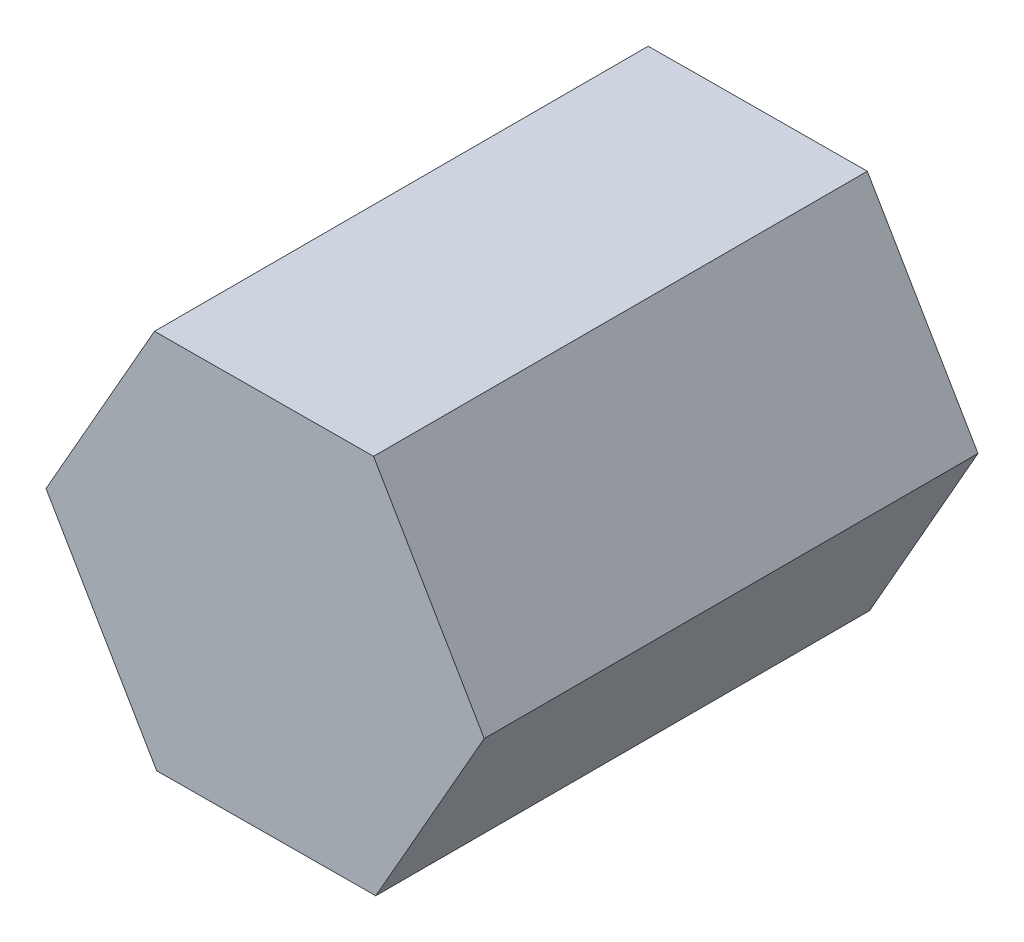
ISO-10303-21;
HEADER;
FILE_DESCRIPTION(('STEP AP214'),'2;1');
FILE_NAME('part.step','',(''),(''),'','','');
FILE_SCHEMA(('AUTOMOTIVE_DESIGN { 1 0 10303 214 1 1 1 1 }'));
ENDSEC;
DATA;
#1=APPLICATION_CONTEXT('core data for automotive mechanical design processes');
#2=APPLICATION_PROTOCOL_DEFINITION('international standard','automotive_design',2000,#1);
#3=PRODUCT_CONTEXT('',#1,'mechanical');
#4=PRODUCT('Part','Part','',(#3));
#5=PRODUCT_RELATED_PRODUCT_CATEGORY('part','',(#4));
#6=PRODUCT_DEFINITION_FORMATION('','',#4);
#7=PRODUCT_DEFINITION_CONTEXT('part definition',#1,'design');
#8=PRODUCT_DEFINITION('design','',#6,#7);
#9=PRODUCT_DEFINITION_SHAPE('','',#8);
#10=(LENGTH_UNIT() NAMED_UNIT(*) SI_UNIT(.MILLI.,.METRE.));
#11=(NAMED_UNIT(*) PLANE_ANGLE_UNIT() SI_UNIT($,.RADIAN.));
#12=(NAMED_UNIT(*) SI_UNIT($,.STERADIAN.) SOLID_ANGLE_UNIT());
#13=UNCERTAINTY_MEASURE_WITH_UNIT(LENGTH_MEASURE(1.E-05),#10,'distance_accuracy_value','');
#14=(GEOMETRIC_REPRESENTATION_CONTEXT(3) GLOBAL_UNCERTAINTY_ASSIGNED_CONTEXT((#13)) GLOBAL_UNIT_ASSIGNED_CONTEXT((#10,
#11,#12)) REPRESENTATION_CONTEXT('',''));
#15=CARTESIAN_POINT('',(0.,0.,0.));
#16=DIRECTION('',(0.,0.,1.));
#17=DIRECTION('',(1.,0.,0.));
#18=AXIS2_PLACEMENT_3D('',#15,#16,#17);
#19=CARTESIAN_POINT('',(35.1393052509974,61.694645038911,160.));
#20=DIRECTION('',(0.00585621832050525,-0.999982852206468,0.));
#21=DIRECTION('',(0.999982852206468,0.00585621832050525,0.));
#22=AXIS2_PLACEMENT_3D('',#19,#20,#21);
#23=PLANE('',#22);
#24=DIRECTION('',(-0.999982852206468,-0.00585621832050525,0.));
#25=VECTOR('',#24,1.);
#26=CARTESIAN_POINT('',(35.1393052509974,61.694645038911,0.));
#27=LINE('',#26,#25);
#28=CARTESIAN_POINT('',(35.1393052509974,61.694645038911,0.));
#29=VERTEX_POINT('',#28);
#30=CARTESIAN_POINT('',(-35.8594772556619,61.2788535381551,0.));
#31=VERTEX_POINT('',#30);
#32=EDGE_CURVE('E117',#29,#31,#27,.T.);
#33=ORIENTED_EDGE('',*,*,#32,.T.);
#34=DIRECTION('',(0.,0.,-1.));
#35=VECTOR('',#34,1.);
#36=CARTESIAN_POINT('',(-35.8594772556619,61.2788535381551,160.));
#37=LINE('',#36,#35);
#38=CARTESIAN_POINT('',(-35.8594772556619,61.2788535381551,160.));
#39=VERTEX_POINT('',#38);
#40=EDGE_CURVE('E11',#39,#31,#37,.T.);
#41=ORIENTED_EDGE('',*,*,#40,.F.);
#42=DIRECTION('',(-0.999982852206468,-0.00585621832050525,0.));
#43=VECTOR('',#42,1.);
#44=CARTESIAN_POINT('',(35.1393052509974,61.694645038911,160.));
#45=LINE('',#44,#43);
#46=CARTESIAN_POINT('',(35.1393052509974,61.694645038911,160.));
#47=VERTEX_POINT('',#46);
#48=EDGE_CURVE('E127',#47,#39,#45,.T.);
#49=ORIENTED_EDGE('',*,*,#48,.F.);
#50=DIRECTION('',(0.,0.,-1.));
#51=VECTOR('',#50,1.);
#52=CARTESIAN_POINT('',(35.1393052509974,61.694645038911,160.));
#53=LINE('',#52,#51);
#54=EDGE_CURVE('E113',#47,#29,#53,.T.);
#55=ORIENTED_EDGE('',*,*,#54,.T.);
#56=EDGE_LOOP('',(#33,#41,#49,#55));
#57=FACE_BOUND('',#56,.T.);
#58=ADVANCED_FACE('F33',(#57),#23,.F.);
#59=CARTESIAN_POINT('',(-35.8594772556619,61.2788535381551,160.));
#60=DIRECTION('',(0.868938662519874,-0.494919792267568,0.));
#61=DIRECTION('',(0.494919792267568,0.868938662519874,0.));
#62=AXIS2_PLACEMENT_3D('',#59,#60,#61);
#63=PLANE('',#62);
#64=DIRECTION('',(-0.494919792267568,-0.868938662519874,0.));
#65=VECTOR('',#64,1.);
#66=CARTESIAN_POINT('',(-35.8594772556619,61.2788535381551,0.));
#67=LINE('',#66,#65);
#68=CARTESIAN_POINT('',(-70.9987825066592,-0.415791500755921,0.));
#69=VERTEX_POINT('',#68);
#70=EDGE_CURVE('E120',#31,#69,#67,.T.);
#71=ORIENTED_EDGE('',*,*,#70,.T.);
#72=DIRECTION('',(0.,0.,-1.));
#73=VECTOR('',#72,1.);
#74=CARTESIAN_POINT('',(-70.9987825066592,-0.415791500755921,160.));
#75=LINE('',#74,#73);
#76=CARTESIAN_POINT('',(-70.9987825066592,-0.415791500755921,160.));
#77=VERTEX_POINT('',#76);
#78=EDGE_CURVE('E41',#77,#69,#75,.T.);
#79=ORIENTED_EDGE('',*,*,#78,.F.);
#80=DIRECTION('',(-0.494919792267568,-0.868938662519874,0.));
#81=VECTOR('',#80,1.);
#82=CARTESIAN_POINT('',(-35.8594772556619,61.2788535381551,160.));
#83=LINE('',#82,#81);
#84=EDGE_CURVE('E86',#39,#77,#83,.T.);
#85=ORIENTED_EDGE('',*,*,#84,.F.);
#86=ORIENTED_EDGE('',*,*,#40,.T.);
#87=EDGE_LOOP('',(#71,#79,#85,#86));
#88=FACE_BOUND('',#87,.T.);
#89=ADVANCED_FACE('F151',(#88),#63,.F.);
#90=CARTESIAN_POINT('',(-70.9987825066592,-0.415791500755921,160.));
#91=DIRECTION('',(0.863082444199368,0.5050630599389,0.));
#92=DIRECTION('',(-0.5050630599389,0.863082444199368,0.));
#93=AXIS2_PLACEMENT_3D('',#90,#91,#92);
#94=PLANE('',#93);
#95=DIRECTION('',(0.5050630599389,-0.863082444199368,0.));
#96=VECTOR('',#95,1.);
#97=CARTESIAN_POINT('',(-70.9987825066592,-0.415791500755921,0.));
#98=LINE('',#97,#96);
#99=CARTESIAN_POINT('',(-35.1393052509973,-61.6946450389111,0.));
#100=VERTEX_POINT('',#99);
#101=EDGE_CURVE('E122',#69,#100,#98,.T.);
#102=ORIENTED_EDGE('',*,*,#101,.T.);
#103=DIRECTION('',(0.,0.,-1.));
#104=VECTOR('',#103,1.);
#105=CARTESIAN_POINT('',(-35.1393052509973,-61.6946450389111,160.));
#106=LINE('',#105,#104);
#107=CARTESIAN_POINT('',(-35.1393052509973,-61.6946450389111,160.));
#108=VERTEX_POINT('',#107);
#109=EDGE_CURVE('E108',#108,#100,#106,.T.);
#110=ORIENTED_EDGE('',*,*,#109,.F.);
#111=DIRECTION('',(0.5050630599389,-0.863082444199368,0.));
#112=VECTOR('',#111,1.);
#113=CARTESIAN_POINT('',(-70.9987825066592,-0.415791500755921,160.));
#114=LINE('',#113,#112);
#115=EDGE_CURVE('E99',#77,#108,#114,.T.);
#116=ORIENTED_EDGE('',*,*,#115,.F.);
#117=ORIENTED_EDGE('',*,*,#78,.T.);
#118=EDGE_LOOP('',(#102,#110,#116,#117));
#119=FACE_BOUND('',#118,.T.);
#120=ADVANCED_FACE('F133',(#119),#94,.F.);
#121=CARTESIAN_POINT('',(-35.1393052509973,-61.6946450389111,160.));
#122=DIRECTION('',(-0.00585621832050565,0.999982852206468,0.));
#123=DIRECTION('',(-0.999982852206468,-0.00585621832050565,0.));
#124=AXIS2_PLACEMENT_3D('',#121,#122,#123);
#125=PLANE('',#124);
#126=DIRECTION('',(0.999982852206468,0.00585621832050565,0.));
#127=VECTOR('',#126,1.);
#128=CARTESIAN_POINT('',(-35.1393052509973,-61.6946450389111,0.));
#129=LINE('',#128,#127);
#130=CARTESIAN_POINT('',(35.8594772556619,-61.2788535381552,0.));
#131=VERTEX_POINT('',#130);
#132=EDGE_CURVE('E107',#100,#131,#129,.T.);
#133=ORIENTED_EDGE('',*,*,#132,.T.);
#134=DIRECTION('',(0.,0.,-1.));
#135=VECTOR('',#134,1.);
#136=CARTESIAN_POINT('',(35.8594772556619,-61.2788535381552,160.));
#137=LINE('',#136,#135);
#138=CARTESIAN_POINT('',(35.8594772556619,-61.2788535381552,160.));
#139=VERTEX_POINT('',#138);
#140=EDGE_CURVE('E104',#139,#131,#137,.T.);
#141=ORIENTED_EDGE('',*,*,#140,.F.);
#142=DIRECTION('',(0.999982852206468,0.00585621832050565,0.));
#143=VECTOR('',#142,1.);
#144=CARTESIAN_POINT('',(-35.1393052509973,-61.6946450389111,160.));
#145=LINE('',#144,#143);
#146=EDGE_CURVE('E93',#108,#139,#145,.T.);
#147=ORIENTED_EDGE('',*,*,#146,.F.);
#148=ORIENTED_EDGE('',*,*,#109,.T.);
#149=EDGE_LOOP('',(#133,#141,#147,#148));
#150=FACE_BOUND('',#149,.T.);
#151=ADVANCED_FACE('F105',(#150),#125,.F.);
#152=CARTESIAN_POINT('',(35.8594772556619,-61.2788535381552,160.));
#153=DIRECTION('',(-0.868938662519874,0.494919792267568,0.));
#154=DIRECTION('',(-0.494919792267568,-0.868938662519874,0.));
#155=AXIS2_PLACEMENT_3D('',#152,#153,#154);
#156=PLANE('',#155);
#157=DIRECTION('',(0.494919792267568,0.868938662519874,0.));
#158=VECTOR('',#157,1.);
#159=CARTESIAN_POINT('',(35.8594772556619,-61.2788535381552,0.));
#160=LINE('',#159,#158);
#161=CARTESIAN_POINT('',(70.9987825066592,0.415791500755879,0.));
#162=VERTEX_POINT('',#161);
#163=EDGE_CURVE('E72',#131,#162,#160,.T.);
#164=ORIENTED_EDGE('',*,*,#163,.T.);
#165=DIRECTION('',(0.,0.,-1.));
#166=VECTOR('',#165,1.);
#167=CARTESIAN_POINT('',(70.9987825066592,0.415791500755879,160.));
#168=LINE('',#167,#166);
#169=CARTESIAN_POINT('',(70.9987825066592,0.415791500755879,160.));
#170=VERTEX_POINT('',#169);
#171=EDGE_CURVE('E109',#170,#162,#168,.T.);
#172=ORIENTED_EDGE('',*,*,#171,.F.);
#173=DIRECTION('',(0.494919792267568,0.868938662519874,0.));
#174=VECTOR('',#173,1.);
#175=CARTESIAN_POINT('',(35.8594772556619,-61.2788535381552,160.));
#176=LINE('',#175,#174);
#177=EDGE_CURVE('E97',#139,#170,#176,.T.);
#178=ORIENTED_EDGE('',*,*,#177,.F.);
#179=ORIENTED_EDGE('',*,*,#140,.T.);
#180=EDGE_LOOP('',(#164,#172,#178,#179));
#181=FACE_BOUND('',#180,.T.);
#182=ADVANCED_FACE('F111',(#181),#156,.F.);
#183=CARTESIAN_POINT('',(70.9987825066592,0.415791500755879,160.));
#184=DIRECTION('',(-0.863082444199368,-0.505063059938899,0.));
#185=DIRECTION('',(0.505063059938899,-0.863082444199368,0.));
#186=AXIS2_PLACEMENT_3D('',#183,#184,#185);
#187=PLANE('',#186);
#188=DIRECTION('',(-0.505063059938899,0.863082444199368,0.));
#189=VECTOR('',#188,1.);
#190=CARTESIAN_POINT('',(70.9987825066592,0.415791500755879,0.));
#191=LINE('',#190,#189);
#192=EDGE_CURVE('E78',#162,#29,#191,.T.);
#193=ORIENTED_EDGE('',*,*,#192,.T.);
#194=ORIENTED_EDGE('',*,*,#54,.F.);
#195=DIRECTION('',(-0.505063059938899,0.863082444199368,0.));
#196=VECTOR('',#195,1.);
#197=CARTESIAN_POINT('',(70.9987825066592,0.415791500755879,160.));
#198=LINE('',#197,#196);
#199=EDGE_CURVE('E49',#170,#47,#198,.T.);
#200=ORIENTED_EDGE('',*,*,#199,.F.);
#201=ORIENTED_EDGE('',*,*,#171,.T.);
#202=EDGE_LOOP('',(#193,#194,#200,#201));
#203=FACE_BOUND('',#202,.T.);
#204=ADVANCED_FACE('F140',(#203),#187,.F.);
#205=CARTESIAN_POINT('',(0.,0.,160.));
#206=DIRECTION('',(0.,0.,1.));
#207=DIRECTION('',(1.,0.,0.));
#208=AXIS2_PLACEMENT_3D('',#205,#206,#207);
#209=PLANE('',#208);
#210=ORIENTED_EDGE('',*,*,#48,.T.);
#211=ORIENTED_EDGE('',*,*,#84,.T.);
#212=ORIENTED_EDGE('',*,*,#115,.T.);
#213=ORIENTED_EDGE('',*,*,#146,.T.);
#214=ORIENTED_EDGE('',*,*,#177,.T.);
#215=ORIENTED_EDGE('',*,*,#199,.T.);
#216=EDGE_LOOP('',(#210,#211,#212,#213,#214,#215));
#217=FACE_BOUND('',#216,.T.);
#218=ADVANCED_FACE('F95',(#217),#209,.T.);
#219=CARTESIAN_POINT('',(0.,0.,0.));
#220=DIRECTION('',(0.,0.,1.));
#221=DIRECTION('',(1.,0.,0.));
#222=AXIS2_PLACEMENT_3D('',#219,#220,#221);
#223=PLANE('',#222);
#224=ORIENTED_EDGE('',*,*,#32,.F.);
#225=ORIENTED_EDGE('',*,*,#192,.F.);
#226=ORIENTED_EDGE('',*,*,#163,.F.);
#227=ORIENTED_EDGE('',*,*,#132,.F.);
#228=ORIENTED_EDGE('',*,*,#101,.F.);
#229=ORIENTED_EDGE('',*,*,#70,.F.);
#230=EDGE_LOOP('',(#224,#225,#226,#227,#228,#229));
#231=FACE_BOUND('',#230,.T.);
#232=ADVANCED_FACE('F136',(#231),#223,.F.);
#233=CLOSED_SHELL('',(#58,#89,#120,#151,#182,#204,#218,#232));
#234=MANIFOLD_SOLID_BREP('B2',#233);
#235=ADVANCED_BREP_SHAPE_REPRESENTATION('',(#18,#234),#14);
#236=SHAPE_DEFINITION_REPRESENTATION(#9,#235);
ENDSEC;
END-ISO-10303-21;
